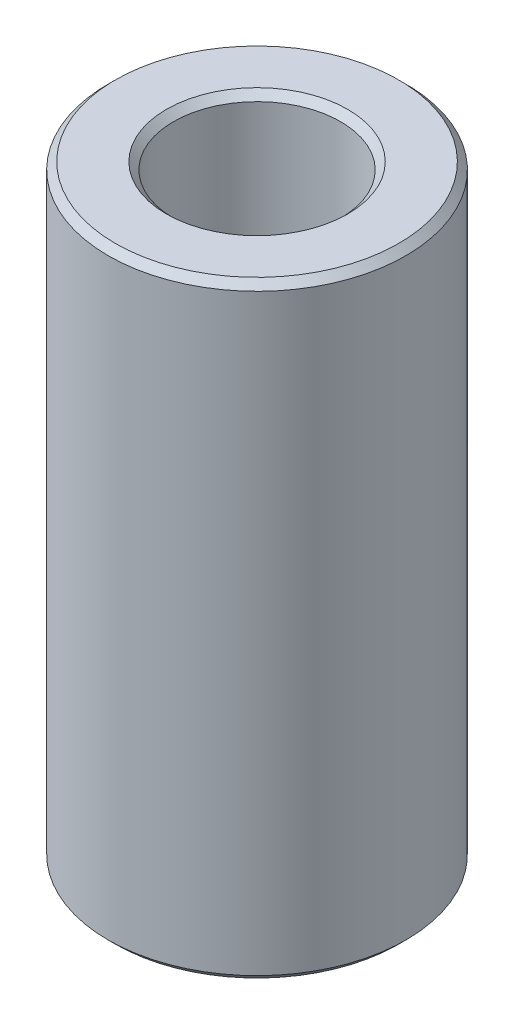
ISO-10303-21;
HEADER;
FILE_DESCRIPTION(('STEP AP214'),'2;1');
FILE_NAME('part.step','',(''),(''),'','','');
FILE_SCHEMA(('AUTOMOTIVE_DESIGN { 1 0 10303 214 1 1 1 1 }'));
ENDSEC;
DATA;
#1=APPLICATION_CONTEXT('core data for automotive mechanical design processes');
#2=APPLICATION_PROTOCOL_DEFINITION('international standard','automotive_design',2000,#1);
#3=PRODUCT_CONTEXT('',#1,'mechanical');
#4=PRODUCT('Part','Part','',(#3));
#5=PRODUCT_RELATED_PRODUCT_CATEGORY('part','',(#4));
#6=PRODUCT_DEFINITION_FORMATION('','',#4);
#7=PRODUCT_DEFINITION_CONTEXT('part definition',#1,'design');
#8=PRODUCT_DEFINITION('design','',#6,#7);
#9=PRODUCT_DEFINITION_SHAPE('','',#8);
#10=(LENGTH_UNIT() NAMED_UNIT(*) SI_UNIT(.MILLI.,.METRE.));
#11=(NAMED_UNIT(*) PLANE_ANGLE_UNIT() SI_UNIT($,.RADIAN.));
#12=(NAMED_UNIT(*) SI_UNIT($,.STERADIAN.) SOLID_ANGLE_UNIT());
#13=UNCERTAINTY_MEASURE_WITH_UNIT(LENGTH_MEASURE(1.E-05),#10,'distance_accuracy_value','');
#14=(GEOMETRIC_REPRESENTATION_CONTEXT(3) GLOBAL_UNCERTAINTY_ASSIGNED_CONTEXT((#13)) GLOBAL_UNIT_ASSIGNED_CONTEXT((#10,
#11,#12)) REPRESENTATION_CONTEXT('',''));
#15=CARTESIAN_POINT('',(0.,0.,0.));
#16=DIRECTION('',(0.,0.,1.));
#17=DIRECTION('',(1.,0.,0.));
#18=AXIS2_PLACEMENT_3D('',#15,#16,#17);
#19=CARTESIAN_POINT('',(0.,163.158003154786,0.));
#20=DIRECTION('',(0.,-1.,0.));
#21=DIRECTION('',(0.,0.,-1.));
#22=AXIS2_PLACEMENT_3D('',#19,#20,#21);
#23=CYLINDRICAL_SURFACE('',#22,40.);
#24=CARTESIAN_POINT('',(0.,1.90750367316234,0.));
#25=DIRECTION('',(0.,1.,0.));
#26=DIRECTION('',(0.,0.,1.));
#27=AXIS2_PLACEMENT_3D('',#24,#25,#26);
#28=CIRCLE('',#27,40.);
#29=CARTESIAN_POINT('',(0.,1.90750367316234,40.));
#30=VERTEX_POINT('',#29);
#31=EDGE_CURVE('E10',#30,#30,#28,.T.);
#32=ORIENTED_EDGE('',*,*,#31,.T.);
#33=EDGE_LOOP('',(#32));
#34=FACE_BOUND('',#33,.T.);
#35=CARTESIAN_POINT('',(0.,161.250499481624,0.));
#36=DIRECTION('',(0.,1.,0.));
#37=DIRECTION('',(0.,0.,1.));
#38=AXIS2_PLACEMENT_3D('',#35,#36,#37);
#39=CIRCLE('',#38,40.);
#40=CARTESIAN_POINT('',(0.,161.250499481624,40.));
#41=VERTEX_POINT('',#40);
#42=EDGE_CURVE('E50',#41,#41,#39,.F.);
#43=ORIENTED_EDGE('',*,*,#42,.T.);
#44=EDGE_LOOP('',(#43));
#45=FACE_BOUND('',#44,.T.);
#46=ADVANCED_FACE('F39',(#34,#45),#23,.T.);
#47=CARTESIAN_POINT('',(0.,163.158003154786,0.));
#48=DIRECTION('',(0.,1.,0.));
#49=DIRECTION('',(0.,0.,1.));
#50=AXIS2_PLACEMENT_3D('',#47,#48,#49);
#51=PLANE('',#50);
#52=CARTESIAN_POINT('',(0.,163.158003154786,0.));
#53=DIRECTION('',(0.,1.,0.));
#54=DIRECTION('',(0.,0.,1.));
#55=AXIS2_PLACEMENT_3D('',#52,#53,#54);
#56=CIRCLE('',#55,24.3774219281993);
#57=CARTESIAN_POINT('',(0.,163.158003154786,24.3774219281993));
#58=VERTEX_POINT('',#57);
#59=EDGE_CURVE('E58',#58,#58,#56,.F.);
#60=ORIENTED_EDGE('',*,*,#59,.T.);
#61=EDGE_LOOP('',(#60));
#62=FACE_BOUND('',#61,.T.);
#63=CARTESIAN_POINT('',(0.,163.158003154786,0.));
#64=DIRECTION('',(0.,1.,0.));
#65=DIRECTION('',(0.,0.,1.));
#66=AXIS2_PLACEMENT_3D('',#63,#64,#65);
#67=CIRCLE('',#66,38.0924963268376);
#68=CARTESIAN_POINT('',(0.,163.158003154786,38.0924963268376));
#69=VERTEX_POINT('',#68);
#70=EDGE_CURVE('E61',#69,#69,#67,.T.);
#71=ORIENTED_EDGE('',*,*,#70,.T.);
#72=EDGE_LOOP('',(#71));
#73=FACE_BOUND('',#72,.T.);
#74=ADVANCED_FACE('F88',(#62,#73),#51,.T.);
#75=CARTESIAN_POINT('',(0.,0.,0.));
#76=DIRECTION('',(0.,1.,0.));
#77=DIRECTION('',(0.,0.,1.));
#78=AXIS2_PLACEMENT_3D('',#75,#76,#77);
#79=PLANE('',#78);
#80=CARTESIAN_POINT('',(0.,0.,0.));
#81=DIRECTION('',(0.,1.,0.));
#82=DIRECTION('',(0.,0.,1.));
#83=AXIS2_PLACEMENT_3D('',#80,#81,#82);
#84=CIRCLE('',#83,24.3774219281993);
#85=CARTESIAN_POINT('',(0.,0.,24.3774219281993));
#86=VERTEX_POINT('',#85);
#87=EDGE_CURVE('E51',#86,#86,#84,.T.);
#88=ORIENTED_EDGE('',*,*,#87,.T.);
#89=EDGE_LOOP('',(#88));
#90=FACE_BOUND('',#89,.T.);
#91=CARTESIAN_POINT('',(0.,0.,0.));
#92=DIRECTION('',(0.,1.,0.));
#93=DIRECTION('',(0.,0.,1.));
#94=AXIS2_PLACEMENT_3D('',#91,#92,#93);
#95=CIRCLE('',#94,38.0924963268376);
#96=CARTESIAN_POINT('',(0.,0.,38.0924963268376));
#97=VERTEX_POINT('',#96);
#98=EDGE_CURVE('E54',#97,#97,#95,.F.);
#99=ORIENTED_EDGE('',*,*,#98,.T.);
#100=EDGE_LOOP('',(#99));
#101=FACE_BOUND('',#100,.T.);
#102=ADVANCED_FACE('F83',(#90,#101),#79,.F.);
#103=CARTESIAN_POINT('',(0.,163.158003154786,0.));
#104=DIRECTION('',(0.,-1.,0.));
#105=DIRECTION('',(0.,0.,-1.));
#106=AXIS2_PLACEMENT_3D('',#103,#104,#105);
#107=CYLINDRICAL_SURFACE('',#106,22.469918255037);
#108=CARTESIAN_POINT('',(0.,161.250499481624,0.));
#109=DIRECTION('',(0.,1.,0.));
#110=DIRECTION('',(0.,0.,1.));
#111=AXIS2_PLACEMENT_3D('',#108,#109,#110);
#112=CIRCLE('',#111,22.469918255037);
#113=CARTESIAN_POINT('',(0.,161.250499481624,22.469918255037));
#114=VERTEX_POINT('',#113);
#115=EDGE_CURVE('E67',#114,#114,#112,.T.);
#116=ORIENTED_EDGE('',*,*,#115,.T.);
#117=EDGE_LOOP('',(#116));
#118=FACE_BOUND('',#117,.T.);
#119=CARTESIAN_POINT('',(0.,1.90750367316236,0.));
#120=DIRECTION('',(0.,1.,0.));
#121=DIRECTION('',(0.,0.,1.));
#122=AXIS2_PLACEMENT_3D('',#119,#120,#121);
#123=CIRCLE('',#122,22.469918255037);
#124=CARTESIAN_POINT('',(0.,1.90750367316236,22.469918255037));
#125=VERTEX_POINT('',#124);
#126=EDGE_CURVE('E69',#125,#125,#123,.F.);
#127=ORIENTED_EDGE('',*,*,#126,.T.);
#128=EDGE_LOOP('',(#127));
#129=FACE_BOUND('',#128,.T.);
#130=ADVANCED_FACE('F71',(#118,#129),#107,.F.);
#131=CARTESIAN_POINT('',(0.,161.250499481624,0.));
#132=DIRECTION('',(0.,1.,0.));
#133=DIRECTION('',(0.,0.,1.));
#134=AXIS2_PLACEMENT_3D('',#131,#132,#133);
#135=CONICAL_SURFACE('',#134,22.469918255037,0.785398163397449);
#136=ORIENTED_EDGE('',*,*,#59,.F.);
#137=EDGE_LOOP('',(#136));
#138=FACE_BOUND('',#137,.T.);
#139=ORIENTED_EDGE('',*,*,#115,.F.);
#140=EDGE_LOOP('',(#139));
#141=FACE_BOUND('',#140,.T.);
#142=ADVANCED_FACE('F77',(#138,#141),#135,.F.);
#143=CARTESIAN_POINT('',(0.,0.,0.));
#144=DIRECTION('',(0.,-1.,0.));
#145=DIRECTION('',(0.,0.,-1.));
#146=AXIS2_PLACEMENT_3D('',#143,#144,#145);
#147=CONICAL_SURFACE('',#146,24.3774219281993,0.785398163397446);
#148=ORIENTED_EDGE('',*,*,#126,.F.);
#149=EDGE_LOOP('',(#148));
#150=FACE_BOUND('',#149,.T.);
#151=ORIENTED_EDGE('',*,*,#87,.F.);
#152=EDGE_LOOP('',(#151));
#153=FACE_BOUND('',#152,.T.);
#154=ADVANCED_FACE('F73',(#150,#153),#147,.F.);
#155=CARTESIAN_POINT('',(0.,1.90750367316234,0.));
#156=DIRECTION('',(0.,1.,0.));
#157=DIRECTION('',(0.,0.,1.));
#158=AXIS2_PLACEMENT_3D('',#155,#156,#157);
#159=CONICAL_SURFACE('',#158,40.,0.785398163397454);
#160=ORIENTED_EDGE('',*,*,#98,.F.);
#161=EDGE_LOOP('',(#160));
#162=FACE_BOUND('',#161,.T.);
#163=ORIENTED_EDGE('',*,*,#31,.F.);
#164=EDGE_LOOP('',(#163));
#165=FACE_BOUND('',#164,.T.);
#166=ADVANCED_FACE('F76',(#162,#165),#159,.T.);
#167=CARTESIAN_POINT('',(0.,163.158003154786,0.));
#168=DIRECTION('',(0.,-1.,0.));
#169=DIRECTION('',(0.,0.,-1.));
#170=AXIS2_PLACEMENT_3D('',#167,#168,#169);
#171=CONICAL_SURFACE('',#170,38.0924963268376,0.785398163397446);
#172=ORIENTED_EDGE('',*,*,#42,.F.);
#173=EDGE_LOOP('',(#172));
#174=FACE_BOUND('',#173,.T.);
#175=ORIENTED_EDGE('',*,*,#70,.F.);
#176=EDGE_LOOP('',(#175));
#177=FACE_BOUND('',#176,.T.);
#178=ADVANCED_FACE('F45',(#174,#177),#171,.T.);
#179=CLOSED_SHELL('',(#46,#74,#102,#130,#142,#154,#166,#178));
#180=MANIFOLD_SOLID_BREP('B2',#179);
#181=ADVANCED_BREP_SHAPE_REPRESENTATION('',(#18,#180),#14);
#182=SHAPE_DEFINITION_REPRESENTATION(#9,#181);
ENDSEC;
END-ISO-10303-21;
